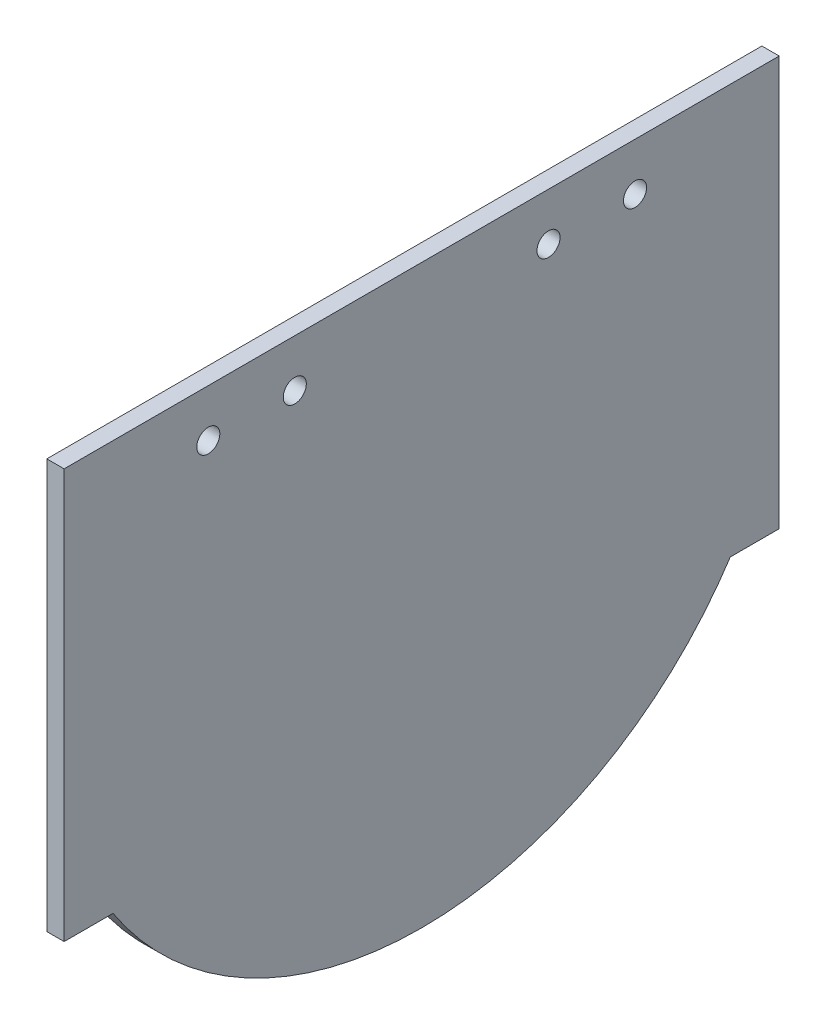
ISO-10303-21;
HEADER;
FILE_DESCRIPTION(('STEP AP214'),'2;1');
FILE_NAME('part.step','',(''),(''),'','','');
FILE_SCHEMA(('AUTOMOTIVE_DESIGN { 1 0 10303 214 1 1 1 1 }'));
ENDSEC;
DATA;
#1=APPLICATION_CONTEXT('core data for automotive mechanical design processes');
#2=APPLICATION_PROTOCOL_DEFINITION('international standard','automotive_design',2000,#1);
#3=PRODUCT_CONTEXT('',#1,'mechanical');
#4=PRODUCT('Part','Part','',(#3));
#5=PRODUCT_RELATED_PRODUCT_CATEGORY('part','',(#4));
#6=PRODUCT_DEFINITION_FORMATION('','',#4);
#7=PRODUCT_DEFINITION_CONTEXT('part definition',#1,'design');
#8=PRODUCT_DEFINITION('design','',#6,#7);
#9=PRODUCT_DEFINITION_SHAPE('','',#8);
#10=(LENGTH_UNIT() NAMED_UNIT(*) SI_UNIT(.MILLI.,.METRE.));
#11=(NAMED_UNIT(*) PLANE_ANGLE_UNIT() SI_UNIT($,.RADIAN.));
#12=(NAMED_UNIT(*) SI_UNIT($,.STERADIAN.) SOLID_ANGLE_UNIT());
#13=UNCERTAINTY_MEASURE_WITH_UNIT(LENGTH_MEASURE(1.E-05),#10,'distance_accuracy_value','');
#14=(GEOMETRIC_REPRESENTATION_CONTEXT(3) GLOBAL_UNCERTAINTY_ASSIGNED_CONTEXT((#13)) GLOBAL_UNIT_ASSIGNED_CONTEXT((#10,
#11,#12)) REPRESENTATION_CONTEXT('',''));
#15=CARTESIAN_POINT('',(0.,0.,0.));
#16=DIRECTION('',(0.,0.,1.));
#17=DIRECTION('',(1.,0.,0.));
#18=AXIS2_PLACEMENT_3D('',#15,#16,#17);
#19=CARTESIAN_POINT('',(-3.,0.,121.));
#20=DIRECTION('',(0.,0.,-1.));
#21=DIRECTION('',(-1.,0.,0.));
#22=AXIS2_PLACEMENT_3D('',#19,#20,#21);
#23=PLANE('',#22);
#24=DIRECTION('',(0.,1.,0.));
#25=VECTOR('',#24,1.);
#26=CARTESIAN_POINT('',(-3.,0.,121.));
#27=LINE('',#26,#25);
#28=CARTESIAN_POINT('',(-3.,33.,121.));
#29=VERTEX_POINT('',#28);
#30=CARTESIAN_POINT('',(-3.,104.,121.));
#31=VERTEX_POINT('',#30);
#32=EDGE_CURVE('E65',#29,#31,#27,.T.);
#33=ORIENTED_EDGE('',*,*,#32,.F.);
#34=DIRECTION('',(1.,0.,0.));
#35=VECTOR('',#34,1.);
#36=CARTESIAN_POINT('',(-3.,33.,121.));
#37=LINE('',#36,#35);
#38=CARTESIAN_POINT('',(0.,33.,121.));
#39=VERTEX_POINT('',#38);
#40=EDGE_CURVE('E83',#29,#39,#37,.T.);
#41=ORIENTED_EDGE('',*,*,#40,.T.);
#42=DIRECTION('',(0.,1.,0.));
#43=VECTOR('',#42,1.);
#44=CARTESIAN_POINT('',(0.,0.,121.));
#45=LINE('',#44,#43);
#46=CARTESIAN_POINT('',(0.,104.,121.));
#47=VERTEX_POINT('',#46);
#48=EDGE_CURVE('E80',#39,#47,#45,.T.);
#49=ORIENTED_EDGE('',*,*,#48,.T.);
#50=DIRECTION('',(1.,0.,0.));
#51=VECTOR('',#50,1.);
#52=CARTESIAN_POINT('',(-3.,104.,121.));
#53=LINE('',#52,#51);
#54=EDGE_CURVE('E11',#31,#47,#53,.T.);
#55=ORIENTED_EDGE('',*,*,#54,.F.);
#56=EDGE_LOOP('',(#33,#41,#49,#55));
#57=FACE_BOUND('',#56,.T.);
#58=ADVANCED_FACE('F40',(#57),#23,.F.);
#59=CARTESIAN_POINT('',(-3.,104.,0.));
#60=DIRECTION('',(0.,1.,0.));
#61=DIRECTION('',(0.,0.,1.));
#62=AXIS2_PLACEMENT_3D('',#59,#60,#61);
#63=PLANE('',#62);
#64=DIRECTION('',(0.,0.,1.));
#65=VECTOR('',#64,1.);
#66=CARTESIAN_POINT('',(0.,104.,0.));
#67=LINE('',#66,#65);
#68=CARTESIAN_POINT('',(0.,104.,-3.00000000000028));
#69=VERTEX_POINT('',#68);
#70=EDGE_CURVE('E89',#69,#47,#67,.T.);
#71=ORIENTED_EDGE('',*,*,#70,.F.);
#72=DIRECTION('',(1.,0.,0.));
#73=VECTOR('',#72,1.);
#74=CARTESIAN_POINT('',(-3.,104.,-3.00000000000028));
#75=LINE('',#74,#73);
#76=CARTESIAN_POINT('',(-3.,104.,-3.00000000000028));
#77=VERTEX_POINT('',#76);
#78=EDGE_CURVE('E44',#77,#69,#75,.T.);
#79=ORIENTED_EDGE('',*,*,#78,.F.);
#80=DIRECTION('',(0.,0.,-1.));
#81=VECTOR('',#80,1.);
#82=CARTESIAN_POINT('',(-3.,104.,0.));
#83=LINE('',#82,#81);
#84=EDGE_CURVE('E96',#31,#77,#83,.T.);
#85=ORIENTED_EDGE('',*,*,#84,.F.);
#86=ORIENTED_EDGE('',*,*,#54,.T.);
#87=EDGE_LOOP('',(#71,#79,#85,#86));
#88=FACE_BOUND('',#87,.T.);
#89=ADVANCED_FACE('F93',(#88),#63,.T.);
#90=CARTESIAN_POINT('',(-3.,0.,-3.00000000000028));
#91=DIRECTION('',(0.,0.,-1.));
#92=DIRECTION('',(-1.,0.,0.));
#93=AXIS2_PLACEMENT_3D('',#90,#91,#92);
#94=PLANE('',#93);
#95=DIRECTION('',(1.,0.,0.));
#96=VECTOR('',#95,1.);
#97=CARTESIAN_POINT('',(-3.,33.,-3.00000000000028));
#98=LINE('',#97,#96);
#99=CARTESIAN_POINT('',(-3.,33.,-3.00000000000028));
#100=VERTEX_POINT('',#99);
#101=CARTESIAN_POINT('',(0.,33.,-3.00000000000028));
#102=VERTEX_POINT('',#101);
#103=EDGE_CURVE('E56',#100,#102,#98,.T.);
#104=ORIENTED_EDGE('',*,*,#103,.F.);
#105=DIRECTION('',(0.,1.,0.));
#106=VECTOR('',#105,1.);
#107=CARTESIAN_POINT('',(-3.,0.,-3.00000000000028));
#108=LINE('',#107,#106);
#109=EDGE_CURVE('E88',#100,#77,#108,.T.);
#110=ORIENTED_EDGE('',*,*,#109,.T.);
#111=ORIENTED_EDGE('',*,*,#78,.T.);
#112=DIRECTION('',(0.,1.,0.));
#113=VECTOR('',#112,1.);
#114=CARTESIAN_POINT('',(0.,0.,-3.00000000000028));
#115=LINE('',#114,#113);
#116=EDGE_CURVE('E100',#102,#69,#115,.T.);
#117=ORIENTED_EDGE('',*,*,#116,.F.);
#118=EDGE_LOOP('',(#104,#110,#111,#117));
#119=FACE_BOUND('',#118,.T.);
#120=ADVANCED_FACE('F42',(#119),#94,.T.);
#121=CARTESIAN_POINT('',(-3.,0.,0.));
#122=DIRECTION('',(1.,0.,0.));
#123=DIRECTION('',(0.,0.,-1.));
#124=AXIS2_PLACEMENT_3D('',#121,#122,#123);
#125=PLANE('',#124);
#126=CARTESIAN_POINT('',(-3.,68.,58.9999999999997));
#127=DIRECTION('',(-1.,0.,0.));
#128=DIRECTION('',(0.,0.,-1.));
#129=AXIS2_PLACEMENT_3D('',#126,#127,#128);
#130=CIRCLE('',#129,63.9485914593304);
#131=CARTESIAN_POINT('',(-3.,33.,5.47970151771968));
#132=VERTEX_POINT('',#131);
#133=CARTESIAN_POINT('',(-3.,33.,112.52029848228));
#134=VERTEX_POINT('',#133);
#135=EDGE_CURVE('E172',#132,#134,#130,.T.);
#136=ORIENTED_EDGE('',*,*,#135,.T.);
#137=DIRECTION('',(0.,0.,1.));
#138=VECTOR('',#137,1.);
#139=CARTESIAN_POINT('',(-3.,33.,112.52029848228));
#140=LINE('',#139,#138);
#141=EDGE_CURVE('E148',#134,#29,#140,.T.);
#142=ORIENTED_EDGE('',*,*,#141,.T.);
#143=ORIENTED_EDGE('',*,*,#32,.T.);
#144=ORIENTED_EDGE('',*,*,#84,.T.);
#145=ORIENTED_EDGE('',*,*,#109,.F.);
#146=DIRECTION('',(0.,0.,1.));
#147=VECTOR('',#146,1.);
#148=CARTESIAN_POINT('',(-3.,33.,-3.00000000000028));
#149=LINE('',#148,#147);
#150=EDGE_CURVE('E162',#100,#132,#149,.T.);
#151=ORIENTED_EDGE('',*,*,#150,.T.);
#152=EDGE_LOOP('',(#136,#142,#143,#144,#145,#151));
#153=FACE_BOUND('',#152,.T.);
#154=CARTESIAN_POINT('',(-3.,95.751318051745,96.));
#155=DIRECTION('',(1.,0.,0.));
#156=DIRECTION('',(0.,0.,-1.));
#157=AXIS2_PLACEMENT_3D('',#154,#155,#156);
#158=CIRCLE('',#157,2.);
#159=CARTESIAN_POINT('',(-3.,95.751318051745,94.));
#160=VERTEX_POINT('',#159);
#161=EDGE_CURVE('E105',#160,#160,#158,.T.);
#162=ORIENTED_EDGE('',*,*,#161,.T.);
#163=EDGE_LOOP('',(#162));
#164=FACE_BOUND('',#163,.T.);
#165=CARTESIAN_POINT('',(-3.,95.751318051745,81.));
#166=DIRECTION('',(1.,0.,0.));
#167=DIRECTION('',(0.,0.,-1.));
#168=AXIS2_PLACEMENT_3D('',#165,#166,#167);
#169=CIRCLE('',#168,2.);
#170=CARTESIAN_POINT('',(-3.,95.751318051745,79.));
#171=VERTEX_POINT('',#170);
#172=EDGE_CURVE('E130',#171,#171,#169,.T.);
#173=ORIENTED_EDGE('',*,*,#172,.T.);
#174=EDGE_LOOP('',(#173));
#175=FACE_BOUND('',#174,.T.);
#176=CARTESIAN_POINT('',(-3.,95.751318051745,37.));
#177=DIRECTION('',(1.,0.,0.));
#178=DIRECTION('',(0.,0.,-1.));
#179=AXIS2_PLACEMENT_3D('',#176,#177,#178);
#180=CIRCLE('',#179,2.);
#181=CARTESIAN_POINT('',(-3.,95.751318051745,35.));
#182=VERTEX_POINT('',#181);
#183=EDGE_CURVE('E122',#182,#182,#180,.T.);
#184=ORIENTED_EDGE('',*,*,#183,.T.);
#185=EDGE_LOOP('',(#184));
#186=FACE_BOUND('',#185,.T.);
#187=CARTESIAN_POINT('',(-3.,95.751318051745,22.));
#188=DIRECTION('',(1.,0.,0.));
#189=DIRECTION('',(0.,0.,-1.));
#190=AXIS2_PLACEMENT_3D('',#187,#188,#189);
#191=CIRCLE('',#190,2.);
#192=CARTESIAN_POINT('',(-3.,95.751318051745,20.));
#193=VERTEX_POINT('',#192);
#194=EDGE_CURVE('E114',#193,#193,#191,.T.);
#195=ORIENTED_EDGE('',*,*,#194,.T.);
#196=EDGE_LOOP('',(#195));
#197=FACE_BOUND('',#196,.T.);
#198=ADVANCED_FACE('F181',(#153,#164,#175,#186,#197),#125,.F.);
#199=CARTESIAN_POINT('',(0.,0.,0.));
#200=DIRECTION('',(1.,0.,0.));
#201=DIRECTION('',(0.,0.,-1.));
#202=AXIS2_PLACEMENT_3D('',#199,#200,#201);
#203=PLANE('',#202);
#204=DIRECTION('',(0.,0.,1.));
#205=VECTOR('',#204,1.);
#206=CARTESIAN_POINT('',(0.,33.,112.52029848228));
#207=LINE('',#206,#205);
#208=CARTESIAN_POINT('',(0.,33.,112.52029848228));
#209=VERTEX_POINT('',#208);
#210=EDGE_CURVE('E158',#209,#39,#207,.T.);
#211=ORIENTED_EDGE('',*,*,#210,.F.);
#212=CARTESIAN_POINT('',(0.,68.,58.9999999999997));
#213=DIRECTION('',(-1.,0.,0.));
#214=DIRECTION('',(0.,0.,-1.));
#215=AXIS2_PLACEMENT_3D('',#212,#213,#214);
#216=CIRCLE('',#215,63.9485914593304);
#217=CARTESIAN_POINT('',(0.,33.,5.47970151771968));
#218=VERTEX_POINT('',#217);
#219=EDGE_CURVE('E163',#218,#209,#216,.T.);
#220=ORIENTED_EDGE('',*,*,#219,.F.);
#221=DIRECTION('',(0.,0.,1.));
#222=VECTOR('',#221,1.);
#223=CARTESIAN_POINT('',(0.,33.,-3.00000000000028));
#224=LINE('',#223,#222);
#225=EDGE_CURVE('E167',#102,#218,#224,.T.);
#226=ORIENTED_EDGE('',*,*,#225,.F.);
#227=ORIENTED_EDGE('',*,*,#116,.T.);
#228=ORIENTED_EDGE('',*,*,#70,.T.);
#229=ORIENTED_EDGE('',*,*,#48,.F.);
#230=EDGE_LOOP('',(#211,#220,#226,#227,#228,#229));
#231=FACE_BOUND('',#230,.T.);
#232=CARTESIAN_POINT('',(0.,95.751318051745,96.));
#233=DIRECTION('',(1.,0.,0.));
#234=DIRECTION('',(0.,0.,-1.));
#235=AXIS2_PLACEMENT_3D('',#232,#233,#234);
#236=CIRCLE('',#235,2.);
#237=CARTESIAN_POINT('',(0.,95.751318051745,94.));
#238=VERTEX_POINT('',#237);
#239=EDGE_CURVE('E138',#238,#238,#236,.T.);
#240=ORIENTED_EDGE('',*,*,#239,.F.);
#241=EDGE_LOOP('',(#240));
#242=FACE_BOUND('',#241,.T.);
#243=CARTESIAN_POINT('',(0.,95.751318051745,81.));
#244=DIRECTION('',(1.,0.,0.));
#245=DIRECTION('',(0.,0.,-1.));
#246=AXIS2_PLACEMENT_3D('',#243,#244,#245);
#247=CIRCLE('',#246,2.);
#248=CARTESIAN_POINT('',(0.,95.751318051745,79.));
#249=VERTEX_POINT('',#248);
#250=EDGE_CURVE('E134',#249,#249,#247,.T.);
#251=ORIENTED_EDGE('',*,*,#250,.F.);
#252=EDGE_LOOP('',(#251));
#253=FACE_BOUND('',#252,.T.);
#254=CARTESIAN_POINT('',(0.,95.751318051745,37.));
#255=DIRECTION('',(1.,0.,0.));
#256=DIRECTION('',(0.,0.,-1.));
#257=AXIS2_PLACEMENT_3D('',#254,#255,#256);
#258=CIRCLE('',#257,2.);
#259=CARTESIAN_POINT('',(0.,95.751318051745,35.));
#260=VERTEX_POINT('',#259);
#261=EDGE_CURVE('E126',#260,#260,#258,.T.);
#262=ORIENTED_EDGE('',*,*,#261,.F.);
#263=EDGE_LOOP('',(#262));
#264=FACE_BOUND('',#263,.T.);
#265=CARTESIAN_POINT('',(0.,95.751318051745,22.));
#266=DIRECTION('',(1.,0.,0.));
#267=DIRECTION('',(0.,0.,-1.));
#268=AXIS2_PLACEMENT_3D('',#265,#266,#267);
#269=CIRCLE('',#268,2.);
#270=CARTESIAN_POINT('',(0.,95.751318051745,20.));
#271=VERTEX_POINT('',#270);
#272=EDGE_CURVE('E118',#271,#271,#269,.T.);
#273=ORIENTED_EDGE('',*,*,#272,.F.);
#274=EDGE_LOOP('',(#273));
#275=FACE_BOUND('',#274,.T.);
#276=ADVANCED_FACE('F97',(#231,#242,#253,#264,#275),#203,.T.);
#277=CARTESIAN_POINT('',(-3.,95.751318051745,22.));
#278=DIRECTION('',(1.,0.,0.));
#279=DIRECTION('',(0.,0.,-1.));
#280=AXIS2_PLACEMENT_3D('',#277,#278,#279);
#281=CYLINDRICAL_SURFACE('',#280,2.);
#282=ORIENTED_EDGE('',*,*,#194,.F.);
#283=EDGE_LOOP('',(#282));
#284=FACE_BOUND('',#283,.T.);
#285=ORIENTED_EDGE('',*,*,#272,.T.);
#286=EDGE_LOOP('',(#285));
#287=FACE_BOUND('',#286,.T.);
#288=ADVANCED_FACE('F210',(#284,#287),#281,.F.);
#289=CARTESIAN_POINT('',(-3.,95.751318051745,37.));
#290=DIRECTION('',(1.,0.,0.));
#291=DIRECTION('',(0.,0.,-1.));
#292=AXIS2_PLACEMENT_3D('',#289,#290,#291);
#293=CYLINDRICAL_SURFACE('',#292,2.);
#294=ORIENTED_EDGE('',*,*,#183,.F.);
#295=EDGE_LOOP('',(#294));
#296=FACE_BOUND('',#295,.T.);
#297=ORIENTED_EDGE('',*,*,#261,.T.);
#298=EDGE_LOOP('',(#297));
#299=FACE_BOUND('',#298,.T.);
#300=ADVANCED_FACE('F214',(#296,#299),#293,.F.);
#301=CARTESIAN_POINT('',(-3.,95.751318051745,81.));
#302=DIRECTION('',(1.,0.,0.));
#303=DIRECTION('',(0.,0.,-1.));
#304=AXIS2_PLACEMENT_3D('',#301,#302,#303);
#305=CYLINDRICAL_SURFACE('',#304,2.);
#306=ORIENTED_EDGE('',*,*,#172,.F.);
#307=EDGE_LOOP('',(#306));
#308=FACE_BOUND('',#307,.T.);
#309=ORIENTED_EDGE('',*,*,#250,.T.);
#310=EDGE_LOOP('',(#309));
#311=FACE_BOUND('',#310,.T.);
#312=ADVANCED_FACE('F218',(#308,#311),#305,.F.);
#313=CARTESIAN_POINT('',(-3.,95.751318051745,96.));
#314=DIRECTION('',(1.,0.,0.));
#315=DIRECTION('',(0.,0.,-1.));
#316=AXIS2_PLACEMENT_3D('',#313,#314,#315);
#317=CYLINDRICAL_SURFACE('',#316,2.);
#318=ORIENTED_EDGE('',*,*,#161,.F.);
#319=EDGE_LOOP('',(#318));
#320=FACE_BOUND('',#319,.T.);
#321=ORIENTED_EDGE('',*,*,#239,.T.);
#322=EDGE_LOOP('',(#321));
#323=FACE_BOUND('',#322,.T.);
#324=ADVANCED_FACE('F222',(#320,#323),#317,.F.);
#325=CARTESIAN_POINT('',(-3.,33.,112.52029848228));
#326=DIRECTION('',(0.,1.,0.));
#327=DIRECTION('',(0.,0.,1.));
#328=AXIS2_PLACEMENT_3D('',#325,#326,#327);
#329=PLANE('',#328);
#330=ORIENTED_EDGE('',*,*,#210,.T.);
#331=ORIENTED_EDGE('',*,*,#40,.F.);
#332=ORIENTED_EDGE('',*,*,#141,.F.);
#333=DIRECTION('',(1.,0.,0.));
#334=VECTOR('',#333,1.);
#335=CARTESIAN_POINT('',(-3.,33.,112.52029848228));
#336=LINE('',#335,#334);
#337=EDGE_CURVE('E152',#134,#209,#336,.T.);
#338=ORIENTED_EDGE('',*,*,#337,.T.);
#339=EDGE_LOOP('',(#330,#331,#332,#338));
#340=FACE_BOUND('',#339,.T.);
#341=ADVANCED_FACE('F226',(#340),#329,.F.);
#342=CARTESIAN_POINT('',(-3.,68.,58.9999999999997));
#343=DIRECTION('',(1.,0.,0.));
#344=DIRECTION('',(0.,0.,-1.));
#345=AXIS2_PLACEMENT_3D('',#342,#343,#344);
#346=CYLINDRICAL_SURFACE('',#345,63.9485914593304);
#347=ORIENTED_EDGE('',*,*,#219,.T.);
#348=ORIENTED_EDGE('',*,*,#337,.F.);
#349=ORIENTED_EDGE('',*,*,#135,.F.);
#350=DIRECTION('',(1.,0.,0.));
#351=VECTOR('',#350,1.);
#352=CARTESIAN_POINT('',(-3.,33.,5.47970151771968));
#353=LINE('',#352,#351);
#354=EDGE_CURVE('E147',#132,#218,#353,.T.);
#355=ORIENTED_EDGE('',*,*,#354,.T.);
#356=EDGE_LOOP('',(#347,#348,#349,#355));
#357=FACE_BOUND('',#356,.T.);
#358=ADVANCED_FACE('F230',(#357),#346,.T.);
#359=CARTESIAN_POINT('',(-3.,33.,-3.00000000000028));
#360=DIRECTION('',(0.,1.,0.));
#361=DIRECTION('',(0.,0.,1.));
#362=AXIS2_PLACEMENT_3D('',#359,#360,#361);
#363=PLANE('',#362);
#364=ORIENTED_EDGE('',*,*,#225,.T.);
#365=ORIENTED_EDGE('',*,*,#354,.F.);
#366=ORIENTED_EDGE('',*,*,#150,.F.);
#367=ORIENTED_EDGE('',*,*,#103,.T.);
#368=EDGE_LOOP('',(#364,#365,#366,#367));
#369=FACE_BOUND('',#368,.T.);
#370=ADVANCED_FACE('F188',(#369),#363,.F.);
#371=CLOSED_SHELL('',(#58,#89,#120,#198,#276,#288,#300,#312,#324,#341,#358,#370));
#372=MANIFOLD_SOLID_BREP('B2',#371);
#373=ADVANCED_BREP_SHAPE_REPRESENTATION('',(#18,#372),#14);
#374=SHAPE_DEFINITION_REPRESENTATION(#9,#373);
ENDSEC;
END-ISO-10303-21;
